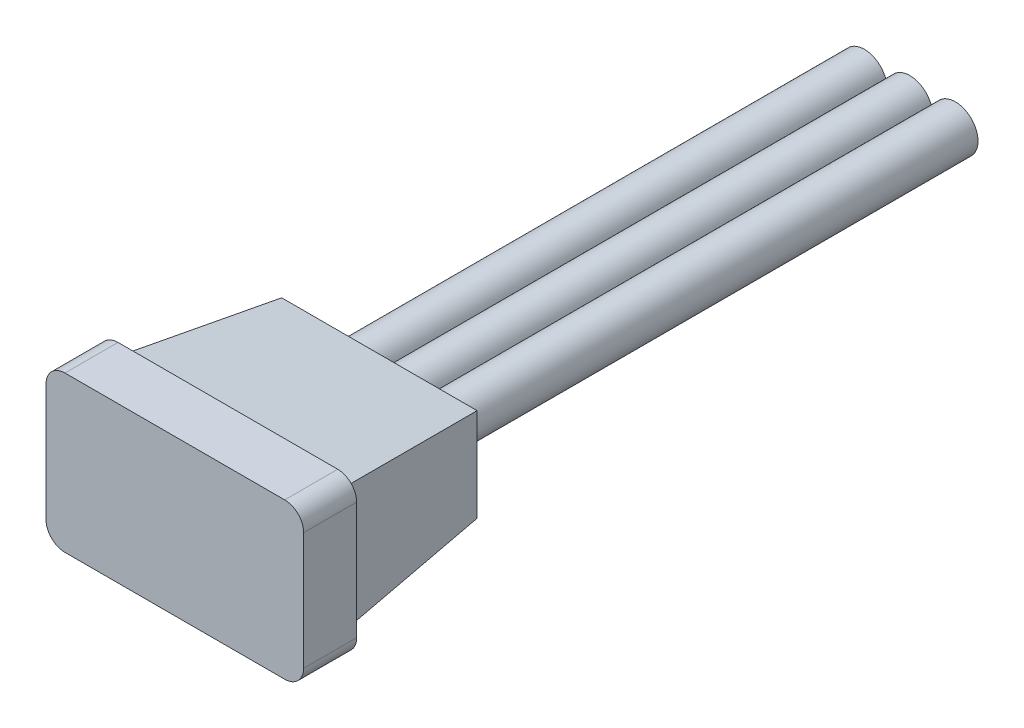
ISO-10303-21;
HEADER;
FILE_DESCRIPTION(('STEP AP214'),'2;1');
FILE_NAME('part.step','',(''),(''),'','','');
FILE_SCHEMA(('AUTOMOTIVE_DESIGN { 1 0 10303 214 1 1 1 1 }'));
ENDSEC;
DATA;
#1=APPLICATION_CONTEXT('core data for automotive mechanical design processes');
#2=APPLICATION_PROTOCOL_DEFINITION('international standard','automotive_design',2000,#1);
#3=PRODUCT_CONTEXT('',#1,'mechanical');
#4=PRODUCT('Part','Part','',(#3));
#5=PRODUCT_RELATED_PRODUCT_CATEGORY('part','',(#4));
#6=PRODUCT_DEFINITION_FORMATION('','',#4);
#7=PRODUCT_DEFINITION_CONTEXT('part definition',#1,'design');
#8=PRODUCT_DEFINITION('design','',#6,#7);
#9=PRODUCT_DEFINITION_SHAPE('','',#8);
#10=(LENGTH_UNIT() NAMED_UNIT(*) SI_UNIT(.MILLI.,.METRE.));
#11=(NAMED_UNIT(*) PLANE_ANGLE_UNIT() SI_UNIT($,.RADIAN.));
#12=(NAMED_UNIT(*) SI_UNIT($,.STERADIAN.) SOLID_ANGLE_UNIT());
#13=UNCERTAINTY_MEASURE_WITH_UNIT(LENGTH_MEASURE(1.E-05),#10,'distance_accuracy_value','');
#14=(GEOMETRIC_REPRESENTATION_CONTEXT(3) GLOBAL_UNCERTAINTY_ASSIGNED_CONTEXT((#13)) GLOBAL_UNIT_ASSIGNED_CONTEXT((#10,
#11,#12)) REPRESENTATION_CONTEXT('',''));
#15=CARTESIAN_POINT('',(0.,0.,0.));
#16=DIRECTION('',(0.,0.,1.));
#17=DIRECTION('',(1.,0.,0.));
#18=AXIS2_PLACEMENT_3D('',#15,#16,#17);
#19=CARTESIAN_POINT('',(1.2,0.,-21.0970562748477));
#20=DIRECTION('',(0.,0.,1.));
#21=DIRECTION('',(1.,0.,0.));
#22=AXIS2_PLACEMENT_3D('',#19,#20,#21);
#23=CYLINDRICAL_SURFACE('',#22,0.6);
#24=CARTESIAN_POINT('',(1.2,0.,-5.4));
#25=DIRECTION('',(0.,0.,-1.));
#26=DIRECTION('',(-1.,0.,0.));
#27=AXIS2_PLACEMENT_3D('',#24,#25,#26);
#28=CIRCLE('',#27,0.6);
#29=CARTESIAN_POINT('',(0.6,0.,-5.4));
#30=VERTEX_POINT('',#29);
#31=EDGE_CURVE('E52',#30,#30,#28,.T.);
#32=ORIENTED_EDGE('',*,*,#31,.T.);
#33=EDGE_LOOP('',(#32));
#34=FACE_BOUND('',#33,.T.);
#35=CARTESIAN_POINT('',(1.2,0.,-19.4));
#36=DIRECTION('',(0.,0.,-1.));
#37=DIRECTION('',(-1.,0.,0.));
#38=AXIS2_PLACEMENT_3D('',#35,#36,#37);
#39=CIRCLE('',#38,0.6);
#40=CARTESIAN_POINT('',(0.6,0.,-19.4));
#41=VERTEX_POINT('',#40);
#42=EDGE_CURVE('E11',#41,#41,#39,.T.);
#43=ORIENTED_EDGE('',*,*,#42,.F.);
#44=EDGE_LOOP('',(#43));
#45=FACE_BOUND('',#44,.T.);
#46=ADVANCED_FACE('F45',(#34,#45),#23,.T.);
#47=CARTESIAN_POINT('',(1.2,0.,-5.4));
#48=DIRECTION('',(0.,0.,-1.));
#49=DIRECTION('',(-1.,0.,0.));
#50=AXIS2_PLACEMENT_3D('',#47,#48,#49);
#51=PLANE('',#50);
#52=ORIENTED_EDGE('',*,*,#31,.F.);
#53=EDGE_LOOP('',(#52));
#54=FACE_BOUND('',#53,.T.);
#55=ADVANCED_FACE('F61',(#54),#51,.F.);
#56=CARTESIAN_POINT('',(0.,0.,-19.4));
#57=DIRECTION('',(0.,0.,-1.));
#58=DIRECTION('',(-1.,0.,0.));
#59=AXIS2_PLACEMENT_3D('',#56,#57,#58);
#60=PLANE('',#59);
#61=ORIENTED_EDGE('',*,*,#42,.T.);
#62=EDGE_LOOP('',(#61));
#63=FACE_BOUND('',#62,.T.);
#64=ADVANCED_FACE('F47',(#63),#60,.T.);
#65=CLOSED_SHELL('',(#46,#55,#64));
#66=MANIFOLD_SOLID_BREP('B2',#65);
#67=CARTESIAN_POINT('',(-1.2,0.,-21.0970562748477));
#68=DIRECTION('',(0.,0.,1.));
#69=DIRECTION('',(1.,0.,0.));
#70=AXIS2_PLACEMENT_3D('',#67,#68,#69);
#71=CYLINDRICAL_SURFACE('',#70,0.6);
#72=CARTESIAN_POINT('',(-1.2,0.,-5.4));
#73=DIRECTION('',(0.,0.,-1.));
#74=DIRECTION('',(-1.,0.,0.));
#75=AXIS2_PLACEMENT_3D('',#72,#73,#74);
#76=CIRCLE('',#75,0.6);
#77=CARTESIAN_POINT('',(-1.8,0.,-5.4));
#78=VERTEX_POINT('',#77);
#79=EDGE_CURVE('E103',#78,#78,#76,.T.);
#80=ORIENTED_EDGE('',*,*,#79,.T.);
#81=EDGE_LOOP('',(#80));
#82=FACE_BOUND('',#81,.T.);
#83=CARTESIAN_POINT('',(-1.2,0.,-19.4));
#84=DIRECTION('',(0.,0.,-1.));
#85=DIRECTION('',(-1.,0.,0.));
#86=AXIS2_PLACEMENT_3D('',#83,#84,#85);
#87=CIRCLE('',#86,0.6);
#88=CARTESIAN_POINT('',(-1.8,0.,-19.4));
#89=VERTEX_POINT('',#88);
#90=EDGE_CURVE('E44',#89,#89,#87,.T.);
#91=ORIENTED_EDGE('',*,*,#90,.F.);
#92=EDGE_LOOP('',(#91));
#93=FACE_BOUND('',#92,.T.);
#94=ADVANCED_FACE('F96',(#82,#93),#71,.T.);
#95=CARTESIAN_POINT('',(-1.2,0.,-5.4));
#96=DIRECTION('',(0.,0.,-1.));
#97=DIRECTION('',(-1.,0.,0.));
#98=AXIS2_PLACEMENT_3D('',#95,#96,#97);
#99=PLANE('',#98);
#100=ORIENTED_EDGE('',*,*,#79,.F.);
#101=EDGE_LOOP('',(#100));
#102=FACE_BOUND('',#101,.T.);
#103=ADVANCED_FACE('F111',(#102),#99,.F.);
#104=CARTESIAN_POINT('',(0.,0.,-19.4));
#105=DIRECTION('',(0.,0.,-1.));
#106=DIRECTION('',(-1.,0.,0.));
#107=AXIS2_PLACEMENT_3D('',#104,#105,#106);
#108=PLANE('',#107);
#109=ORIENTED_EDGE('',*,*,#90,.T.);
#110=EDGE_LOOP('',(#109));
#111=FACE_BOUND('',#110,.T.);
#112=ADVANCED_FACE('F98',(#111),#108,.T.);
#113=CLOSED_SHELL('',(#94,#103,#112));
#114=MANIFOLD_SOLID_BREP('B6',#113);
#115=CARTESIAN_POINT('',(0.,0.,-1.4));
#116=DIRECTION('',(0.,0.,1.));
#117=DIRECTION('',(1.,0.,0.));
#118=AXIS2_PLACEMENT_3D('',#115,#116,#117);
#119=PLANE('',#118);
#120=DIRECTION('',(1.,0.,0.));
#121=VECTOR('',#120,1.);
#122=CARTESIAN_POINT('',(-3.4,-2.05,-1.4));
#123=LINE('',#122,#121);
#124=CARTESIAN_POINT('',(-2.9,-2.05,-1.4));
#125=VERTEX_POINT('',#124);
#126=CARTESIAN_POINT('',(2.9,-2.05,-1.4));
#127=VERTEX_POINT('',#126);
#128=EDGE_CURVE('E291',#125,#127,#123,.T.);
#129=ORIENTED_EDGE('',*,*,#128,.F.);
#130=CARTESIAN_POINT('',(-2.9,-1.55,-1.4));
#131=DIRECTION('',(0.,0.,1.));
#132=DIRECTION('',(1.,0.,0.));
#133=AXIS2_PLACEMENT_3D('',#130,#131,#132);
#134=CIRCLE('',#133,0.5);
#135=CARTESIAN_POINT('',(-3.4,-1.55,-1.4));
#136=VERTEX_POINT('',#135);
#137=EDGE_CURVE('E333',#125,#136,#134,.F.);
#138=ORIENTED_EDGE('',*,*,#137,.T.);
#139=DIRECTION('',(0.,-1.,0.));
#140=VECTOR('',#139,1.);
#141=CARTESIAN_POINT('',(-3.4,2.05,-1.4));
#142=LINE('',#141,#140);
#143=CARTESIAN_POINT('',(-3.4,1.55,-1.4));
#144=VERTEX_POINT('',#143);
#145=EDGE_CURVE('E287',#144,#136,#142,.T.);
#146=ORIENTED_EDGE('',*,*,#145,.F.);
#147=CARTESIAN_POINT('',(-2.9,1.55,-1.4));
#148=DIRECTION('',(0.,0.,1.));
#149=DIRECTION('',(1.,0.,0.));
#150=AXIS2_PLACEMENT_3D('',#147,#148,#149);
#151=CIRCLE('',#150,0.5);
#152=CARTESIAN_POINT('',(-2.9,2.05,-1.4));
#153=VERTEX_POINT('',#152);
#154=EDGE_CURVE('E151',#144,#153,#151,.F.);
#155=ORIENTED_EDGE('',*,*,#154,.T.);
#156=DIRECTION('',(-1.,0.,0.));
#157=VECTOR('',#156,1.);
#158=CARTESIAN_POINT('',(-3.4,2.05,-1.4));
#159=LINE('',#158,#157);
#160=CARTESIAN_POINT('',(2.9,2.05,-1.4));
#161=VERTEX_POINT('',#160);
#162=EDGE_CURVE('E284',#161,#153,#159,.T.);
#163=ORIENTED_EDGE('',*,*,#162,.F.);
#164=CARTESIAN_POINT('',(2.9,1.55,-1.4));
#165=DIRECTION('',(0.,0.,1.));
#166=DIRECTION('',(1.,0.,0.));
#167=AXIS2_PLACEMENT_3D('',#164,#165,#166);
#168=CIRCLE('',#167,0.5);
#169=CARTESIAN_POINT('',(3.4,1.55,-1.4));
#170=VERTEX_POINT('',#169);
#171=EDGE_CURVE('E327',#161,#170,#168,.F.);
#172=ORIENTED_EDGE('',*,*,#171,.T.);
#173=DIRECTION('',(0.,1.,0.));
#174=VECTOR('',#173,1.);
#175=CARTESIAN_POINT('',(3.4,2.05,-1.4));
#176=LINE('',#175,#174);
#177=CARTESIAN_POINT('',(3.4,-1.55,-1.4));
#178=VERTEX_POINT('',#177);
#179=EDGE_CURVE('E281',#178,#170,#176,.T.);
#180=ORIENTED_EDGE('',*,*,#179,.F.);
#181=CARTESIAN_POINT('',(2.9,-1.55,-1.4));
#182=DIRECTION('',(0.,0.,1.));
#183=DIRECTION('',(1.,0.,0.));
#184=AXIS2_PLACEMENT_3D('',#181,#182,#183);
#185=CIRCLE('',#184,0.5);
#186=EDGE_CURVE('E329',#178,#127,#185,.F.);
#187=ORIENTED_EDGE('',*,*,#186,.T.);
#188=EDGE_LOOP('',(#129,#138,#146,#155,#163,#172,#180,#187));
#189=FACE_BOUND('',#188,.T.);
#190=DIRECTION('',(1.,0.,0.));
#191=VECTOR('',#190,1.);
#192=CARTESIAN_POINT('',(-3.,1.65,-1.4));
#193=LINE('',#192,#191);
#194=CARTESIAN_POINT('',(-3.,1.65,-1.4));
#195=VERTEX_POINT('',#194);
#196=CARTESIAN_POINT('',(3.,1.65,-1.4));
#197=VERTEX_POINT('',#196);
#198=EDGE_CURVE('E254',#195,#197,#193,.T.);
#199=ORIENTED_EDGE('',*,*,#198,.F.);
#200=DIRECTION('',(0.,1.,0.));
#201=VECTOR('',#200,1.);
#202=CARTESIAN_POINT('',(-3.,-1.65,-1.4));
#203=LINE('',#202,#201);
#204=CARTESIAN_POINT('',(-3.,-1.65,-1.4));
#205=VERTEX_POINT('',#204);
#206=EDGE_CURVE('E239',#205,#195,#203,.T.);
#207=ORIENTED_EDGE('',*,*,#206,.F.);
#208=DIRECTION('',(-1.,0.,0.));
#209=VECTOR('',#208,1.);
#210=CARTESIAN_POINT('',(3.,-1.65,-1.4));
#211=LINE('',#210,#209);
#212=CARTESIAN_POINT('',(3.,-1.65,-1.4));
#213=VERTEX_POINT('',#212);
#214=EDGE_CURVE('E234',#213,#205,#211,.T.);
#215=ORIENTED_EDGE('',*,*,#214,.F.);
#216=DIRECTION('',(0.,-1.,0.));
#217=VECTOR('',#216,1.);
#218=CARTESIAN_POINT('',(3.,1.65,-1.4));
#219=LINE('',#218,#217);
#220=EDGE_CURVE('E236',#197,#213,#219,.T.);
#221=ORIENTED_EDGE('',*,*,#220,.F.);
#222=EDGE_LOOP('',(#199,#207,#215,#221));
#223=FACE_BOUND('',#222,.T.);
#224=ADVANCED_FACE('F136',(#189,#223),#119,.F.);
#225=CARTESIAN_POINT('',(3.4,2.05,-1.4));
#226=DIRECTION('',(1.,0.,0.));
#227=DIRECTION('',(0.,1.,0.));
#228=AXIS2_PLACEMENT_3D('',#225,#226,#227);
#229=PLANE('',#228);
#230=DIRECTION('',(0.,1.,0.));
#231=VECTOR('',#230,1.);
#232=CARTESIAN_POINT('',(3.4,2.05,0.));
#233=LINE('',#232,#231);
#234=CARTESIAN_POINT('',(3.4,-1.55,0.));
#235=VERTEX_POINT('',#234);
#236=CARTESIAN_POINT('',(3.4,1.55,0.));
#237=VERTEX_POINT('',#236);
#238=EDGE_CURVE('E263',#235,#237,#233,.T.);
#239=ORIENTED_EDGE('',*,*,#238,.F.);
#240=DIRECTION('',(0.,0.,1.));
#241=VECTOR('',#240,1.);
#242=CARTESIAN_POINT('',(3.4,-1.55,-1.4));
#243=LINE('',#242,#241);
#244=EDGE_CURVE('E94',#235,#178,#243,.F.);
#245=ORIENTED_EDGE('',*,*,#244,.T.);
#246=ORIENTED_EDGE('',*,*,#179,.T.);
#247=DIRECTION('',(0.,0.,1.));
#248=VECTOR('',#247,1.);
#249=CARTESIAN_POINT('',(3.4,1.55,-1.4));
#250=LINE('',#249,#248);
#251=EDGE_CURVE('E144',#170,#237,#250,.T.);
#252=ORIENTED_EDGE('',*,*,#251,.T.);
#253=EDGE_LOOP('',(#239,#245,#246,#252));
#254=FACE_BOUND('',#253,.T.);
#255=ADVANCED_FACE('F343',(#254),#229,.T.);
#256=CARTESIAN_POINT('',(-3.4,-2.05,-1.4));
#257=DIRECTION('',(0.,-1.,0.));
#258=DIRECTION('',(0.,0.,-1.));
#259=AXIS2_PLACEMENT_3D('',#256,#257,#258);
#260=PLANE('',#259);
#261=DIRECTION('',(1.,0.,0.));
#262=VECTOR('',#261,1.);
#263=CARTESIAN_POINT('',(-3.4,-2.05,0.));
#264=LINE('',#263,#262);
#265=CARTESIAN_POINT('',(-2.9,-2.05,0.));
#266=VERTEX_POINT('',#265);
#267=CARTESIAN_POINT('',(2.9,-2.05,0.));
#268=VERTEX_POINT('',#267);
#269=EDGE_CURVE('E285',#266,#268,#264,.T.);
#270=ORIENTED_EDGE('',*,*,#269,.F.);
#271=DIRECTION('',(0.,0.,1.));
#272=VECTOR('',#271,1.);
#273=CARTESIAN_POINT('',(-2.9,-2.05,-1.4));
#274=LINE('',#273,#272);
#275=EDGE_CURVE('E324',#266,#125,#274,.F.);
#276=ORIENTED_EDGE('',*,*,#275,.T.);
#277=ORIENTED_EDGE('',*,*,#128,.T.);
#278=DIRECTION('',(0.,0.,1.));
#279=VECTOR('',#278,1.);
#280=CARTESIAN_POINT('',(2.9,-2.05,-1.4));
#281=LINE('',#280,#279);
#282=EDGE_CURVE('E321',#127,#268,#281,.T.);
#283=ORIENTED_EDGE('',*,*,#282,.T.);
#284=EDGE_LOOP('',(#270,#276,#277,#283));
#285=FACE_BOUND('',#284,.T.);
#286=ADVANCED_FACE('F356',(#285),#260,.T.);
#287=CARTESIAN_POINT('',(-3.4,2.05,-1.4));
#288=DIRECTION('',(-1.,0.,0.));
#289=DIRECTION('',(0.,-1.,0.));
#290=AXIS2_PLACEMENT_3D('',#287,#288,#289);
#291=PLANE('',#290);
#292=ORIENTED_EDGE('',*,*,#145,.T.);
#293=DIRECTION('',(0.,0.,1.));
#294=VECTOR('',#293,1.);
#295=CARTESIAN_POINT('',(-3.4,-1.55,-1.4));
#296=LINE('',#295,#294);
#297=CARTESIAN_POINT('',(-3.4,-1.55,0.));
#298=VERTEX_POINT('',#297);
#299=EDGE_CURVE('E309',#136,#298,#296,.T.);
#300=ORIENTED_EDGE('',*,*,#299,.T.);
#301=DIRECTION('',(0.,-1.,0.));
#302=VECTOR('',#301,1.);
#303=CARTESIAN_POINT('',(-3.4,2.05,0.));
#304=LINE('',#303,#302);
#305=CARTESIAN_POINT('',(-3.4,1.55,0.));
#306=VERTEX_POINT('',#305);
#307=EDGE_CURVE('E301',#306,#298,#304,.T.);
#308=ORIENTED_EDGE('',*,*,#307,.F.);
#309=DIRECTION('',(0.,0.,1.));
#310=VECTOR('',#309,1.);
#311=CARTESIAN_POINT('',(-3.4,1.55,-1.4));
#312=LINE('',#311,#310);
#313=EDGE_CURVE('E306',#306,#144,#312,.F.);
#314=ORIENTED_EDGE('',*,*,#313,.T.);
#315=EDGE_LOOP('',(#292,#300,#308,#314));
#316=FACE_BOUND('',#315,.T.);
#317=ADVANCED_FACE('F365',(#316),#291,.T.);
#318=CARTESIAN_POINT('',(-3.4,2.05,-1.4));
#319=DIRECTION('',(0.,1.,0.));
#320=DIRECTION('',(0.,0.,1.));
#321=AXIS2_PLACEMENT_3D('',#318,#319,#320);
#322=PLANE('',#321);
#323=ORIENTED_EDGE('',*,*,#162,.T.);
#324=DIRECTION('',(0.,0.,1.));
#325=VECTOR('',#324,1.);
#326=CARTESIAN_POINT('',(-2.9,2.05,-1.4));
#327=LINE('',#326,#325);
#328=CARTESIAN_POINT('',(-2.9,2.05,0.));
#329=VERTEX_POINT('',#328);
#330=EDGE_CURVE('E337',#153,#329,#327,.T.);
#331=ORIENTED_EDGE('',*,*,#330,.T.);
#332=DIRECTION('',(-1.,0.,0.));
#333=VECTOR('',#332,1.);
#334=CARTESIAN_POINT('',(-3.4,2.05,0.));
#335=LINE('',#334,#333);
#336=CARTESIAN_POINT('',(2.9,2.05,0.));
#337=VERTEX_POINT('',#336);
#338=EDGE_CURVE('E298',#337,#329,#335,.T.);
#339=ORIENTED_EDGE('',*,*,#338,.F.);
#340=DIRECTION('',(0.,0.,1.));
#341=VECTOR('',#340,1.);
#342=CARTESIAN_POINT('',(2.9,2.05,-1.4));
#343=LINE('',#342,#341);
#344=EDGE_CURVE('E158',#337,#161,#343,.F.);
#345=ORIENTED_EDGE('',*,*,#344,.T.);
#346=EDGE_LOOP('',(#323,#331,#339,#345));
#347=FACE_BOUND('',#346,.T.);
#348=ADVANCED_FACE('F370',(#347),#322,.T.);
#349=CARTESIAN_POINT('',(0.,0.,0.));
#350=DIRECTION('',(0.,0.,1.));
#351=DIRECTION('',(1.,0.,0.));
#352=AXIS2_PLACEMENT_3D('',#349,#350,#351);
#353=PLANE('',#352);
#354=ORIENTED_EDGE('',*,*,#307,.T.);
#355=CARTESIAN_POINT('',(-2.9,-1.55,0.));
#356=DIRECTION('',(0.,0.,1.));
#357=DIRECTION('',(1.,0.,0.));
#358=AXIS2_PLACEMENT_3D('',#355,#356,#357);
#359=CIRCLE('',#358,0.5);
#360=EDGE_CURVE('E319',#298,#266,#359,.T.);
#361=ORIENTED_EDGE('',*,*,#360,.T.);
#362=ORIENTED_EDGE('',*,*,#269,.T.);
#363=CARTESIAN_POINT('',(2.9,-1.55,0.));
#364=DIRECTION('',(0.,0.,1.));
#365=DIRECTION('',(1.,0.,0.));
#366=AXIS2_PLACEMENT_3D('',#363,#364,#365);
#367=CIRCLE('',#366,0.5);
#368=EDGE_CURVE('E315',#268,#235,#367,.T.);
#369=ORIENTED_EDGE('',*,*,#368,.T.);
#370=ORIENTED_EDGE('',*,*,#238,.T.);
#371=CARTESIAN_POINT('',(2.9,1.55,0.));
#372=DIRECTION('',(0.,0.,1.));
#373=DIRECTION('',(1.,0.,0.));
#374=AXIS2_PLACEMENT_3D('',#371,#372,#373);
#375=CIRCLE('',#374,0.5);
#376=EDGE_CURVE('E313',#237,#337,#375,.T.);
#377=ORIENTED_EDGE('',*,*,#376,.T.);
#378=ORIENTED_EDGE('',*,*,#338,.T.);
#379=CARTESIAN_POINT('',(-2.9,1.55,0.));
#380=DIRECTION('',(0.,0.,1.));
#381=DIRECTION('',(1.,0.,0.));
#382=AXIS2_PLACEMENT_3D('',#379,#380,#381);
#383=CIRCLE('',#382,0.5);
#384=EDGE_CURVE('E317',#329,#306,#383,.T.);
#385=ORIENTED_EDGE('',*,*,#384,.T.);
#386=EDGE_LOOP('',(#354,#361,#362,#369,#370,#377,#378,#385));
#387=FACE_BOUND('',#386,.T.);
#388=ADVANCED_FACE('F349',(#387),#353,.T.);
#389=CARTESIAN_POINT('',(-3.,1.65,-1.4));
#390=DIRECTION('',(0.,0.994521895368273,-0.104528463267654));
#391=DIRECTION('',(0.,0.104528463267654,0.994521895368273));
#392=AXIS2_PLACEMENT_3D('',#389,#390,#391);
#393=PLANE('',#392);
#394=ORIENTED_EDGE('',*,*,#198,.T.);
#395=DIRECTION('',(0.103962051184498,0.103962051184498,0.989132844377854));
#396=VECTOR('',#395,1.);
#397=CARTESIAN_POINT('',(3.,1.65,-1.4));
#398=LINE('',#397,#396);
#399=CARTESIAN_POINT('',(2.57958305893729,1.22958305893729,-5.4));
#400=VERTEX_POINT('',#399);
#401=EDGE_CURVE('E252',#400,#197,#398,.T.);
#402=ORIENTED_EDGE('',*,*,#401,.F.);
#403=DIRECTION('',(-1.,0.,0.));
#404=VECTOR('',#403,1.);
#405=CARTESIAN_POINT('',(-3.,1.22958305893729,-5.4));
#406=LINE('',#405,#404);
#407=CARTESIAN_POINT('',(-2.57958305893729,1.22958305893729,-5.4));
#408=VERTEX_POINT('',#407);
#409=EDGE_CURVE('E270',#408,#400,#406,.F.);
#410=ORIENTED_EDGE('',*,*,#409,.F.);
#411=DIRECTION('',(-0.103962051184498,0.103962051184498,0.989132844377854));
#412=VECTOR('',#411,1.);
#413=CARTESIAN_POINT('',(-3.,1.65,-1.4));
#414=LINE('',#413,#412);
#415=EDGE_CURVE('E266',#408,#195,#414,.T.);
#416=ORIENTED_EDGE('',*,*,#415,.T.);
#417=EDGE_LOOP('',(#394,#402,#410,#416));
#418=FACE_BOUND('',#417,.T.);
#419=ADVANCED_FACE('F386',(#418),#393,.T.);
#420=CARTESIAN_POINT('',(3.,1.65,-1.4));
#421=DIRECTION('',(0.994521895368273,0.,-0.104528463267654));
#422=DIRECTION('',(-0.104528463267654,0.,-0.994521895368273));
#423=AXIS2_PLACEMENT_3D('',#420,#421,#422);
#424=PLANE('',#423);
#425=ORIENTED_EDGE('',*,*,#220,.T.);
#426=DIRECTION('',(0.103962051184498,-0.103962051184498,0.989132844377854));
#427=VECTOR('',#426,1.);
#428=CARTESIAN_POINT('',(3.,-1.65,-1.4));
#429=LINE('',#428,#427);
#430=CARTESIAN_POINT('',(2.57958305893729,-1.22958305893729,-5.4));
#431=VERTEX_POINT('',#430);
#432=EDGE_CURVE('E249',#431,#213,#429,.T.);
#433=ORIENTED_EDGE('',*,*,#432,.F.);
#434=DIRECTION('',(0.,1.,0.));
#435=VECTOR('',#434,1.);
#436=CARTESIAN_POINT('',(2.57958305893729,1.65,-5.4));
#437=LINE('',#436,#435);
#438=EDGE_CURVE('E274',#400,#431,#437,.F.);
#439=ORIENTED_EDGE('',*,*,#438,.F.);
#440=ORIENTED_EDGE('',*,*,#401,.T.);
#441=EDGE_LOOP('',(#425,#433,#439,#440));
#442=FACE_BOUND('',#441,.T.);
#443=ADVANCED_FACE('F248',(#442),#424,.T.);
#444=CARTESIAN_POINT('',(3.,-1.65,-1.4));
#445=DIRECTION('',(0.,-0.994521895368273,-0.104528463267654));
#446=DIRECTION('',(0.,0.104528463267654,-0.994521895368273));
#447=AXIS2_PLACEMENT_3D('',#444,#445,#446);
#448=PLANE('',#447);
#449=ORIENTED_EDGE('',*,*,#214,.T.);
#450=DIRECTION('',(-0.103962051184498,-0.103962051184498,0.989132844377854));
#451=VECTOR('',#450,1.);
#452=CARTESIAN_POINT('',(-3.,-1.65,-1.4));
#453=LINE('',#452,#451);
#454=CARTESIAN_POINT('',(-2.57958305893729,-1.22958305893729,-5.4));
#455=VERTEX_POINT('',#454);
#456=EDGE_CURVE('E259',#455,#205,#453,.T.);
#457=ORIENTED_EDGE('',*,*,#456,.F.);
#458=DIRECTION('',(1.,0.,0.));
#459=VECTOR('',#458,1.);
#460=CARTESIAN_POINT('',(3.,-1.22958305893729,-5.4));
#461=LINE('',#460,#459);
#462=EDGE_CURVE('E257',#431,#455,#461,.F.);
#463=ORIENTED_EDGE('',*,*,#462,.F.);
#464=ORIENTED_EDGE('',*,*,#432,.T.);
#465=EDGE_LOOP('',(#449,#457,#463,#464));
#466=FACE_BOUND('',#465,.T.);
#467=ADVANCED_FACE('F256',(#466),#448,.T.);
#468=CARTESIAN_POINT('',(-3.,-1.65,-1.4));
#469=DIRECTION('',(-0.994521895368273,0.,-0.104528463267654));
#470=DIRECTION('',(-0.104528463267654,0.,0.994521895368273));
#471=AXIS2_PLACEMENT_3D('',#468,#469,#470);
#472=PLANE('',#471);
#473=ORIENTED_EDGE('',*,*,#206,.T.);
#474=ORIENTED_EDGE('',*,*,#415,.F.);
#475=DIRECTION('',(0.,-1.,0.));
#476=VECTOR('',#475,1.);
#477=CARTESIAN_POINT('',(-2.57958305893729,-1.65,-5.4));
#478=LINE('',#477,#476);
#479=EDGE_CURVE('E278',#455,#408,#478,.F.);
#480=ORIENTED_EDGE('',*,*,#479,.F.);
#481=ORIENTED_EDGE('',*,*,#456,.T.);
#482=EDGE_LOOP('',(#473,#474,#480,#481));
#483=FACE_BOUND('',#482,.T.);
#484=ADVANCED_FACE('F445',(#483),#472,.T.);
#485=CARTESIAN_POINT('',(0.,0.,-5.4));
#486=DIRECTION('',(0.,0.,-1.));
#487=DIRECTION('',(-1.,0.,0.));
#488=AXIS2_PLACEMENT_3D('',#485,#486,#487);
#489=PLANE('',#488);
#490=CARTESIAN_POINT('',(0.,0.,-5.4));
#491=DIRECTION('',(0.,0.,-1.));
#492=DIRECTION('',(-1.,0.,0.));
#493=AXIS2_PLACEMENT_3D('',#490,#491,#492);
#494=CIRCLE('',#493,0.6);
#495=CARTESIAN_POINT('',(-0.6,0.,-5.4));
#496=VERTEX_POINT('',#495);
#497=EDGE_CURVE('E295',#496,#496,#494,.T.);
#498=ORIENTED_EDGE('',*,*,#497,.F.);
#499=EDGE_LOOP('',(#498));
#500=FACE_BOUND('',#499,.T.);
#501=ORIENTED_EDGE('',*,*,#409,.T.);
#502=ORIENTED_EDGE('',*,*,#438,.T.);
#503=ORIENTED_EDGE('',*,*,#462,.T.);
#504=ORIENTED_EDGE('',*,*,#479,.T.);
#505=EDGE_LOOP('',(#501,#502,#503,#504));
#506=FACE_BOUND('',#505,.T.);
#507=ADVANCED_FACE('F435',(#500,#506),#489,.T.);
#508=CARTESIAN_POINT('',(0.,0.,-19.4));
#509=DIRECTION('',(0.,0.,1.));
#510=DIRECTION('',(1.,0.,0.));
#511=AXIS2_PLACEMENT_3D('',#508,#509,#510);
#512=CYLINDRICAL_SURFACE('',#511,0.6);
#513=CARTESIAN_POINT('',(0.,0.,-19.4));
#514=DIRECTION('',(0.,0.,-1.));
#515=DIRECTION('',(-1.,0.,0.));
#516=AXIS2_PLACEMENT_3D('',#513,#514,#515);
#517=CIRCLE('',#516,0.6);
#518=CARTESIAN_POINT('',(-0.6,0.,-19.4));
#519=VERTEX_POINT('',#518);
#520=EDGE_CURVE('E520',#519,#519,#517,.T.);
#521=ORIENTED_EDGE('',*,*,#520,.F.);
#522=EDGE_LOOP('',(#521));
#523=FACE_BOUND('',#522,.T.);
#524=ORIENTED_EDGE('',*,*,#497,.T.);
#525=EDGE_LOOP('',(#524));
#526=FACE_BOUND('',#525,.T.);
#527=ADVANCED_FACE('F426',(#523,#526),#512,.T.);
#528=CARTESIAN_POINT('',(0.,0.,-19.4));
#529=DIRECTION('',(0.,0.,-1.));
#530=DIRECTION('',(-1.,0.,0.));
#531=AXIS2_PLACEMENT_3D('',#528,#529,#530);
#532=PLANE('',#531);
#533=ORIENTED_EDGE('',*,*,#520,.T.);
#534=EDGE_LOOP('',(#533));
#535=FACE_BOUND('',#534,.T.);
#536=ADVANCED_FACE('F395',(#535),#532,.T.);
#537=CARTESIAN_POINT('',(-2.9,-1.55,-1.4));
#538=DIRECTION('',(0.,0.,1.));
#539=DIRECTION('',(1.,0.,0.));
#540=AXIS2_PLACEMENT_3D('',#537,#538,#539);
#541=CYLINDRICAL_SURFACE('',#540,0.5);
#542=ORIENTED_EDGE('',*,*,#137,.F.);
#543=ORIENTED_EDGE('',*,*,#275,.F.);
#544=ORIENTED_EDGE('',*,*,#360,.F.);
#545=ORIENTED_EDGE('',*,*,#299,.F.);
#546=EDGE_LOOP('',(#542,#543,#544,#545));
#547=FACE_BOUND('',#546,.T.);
#548=ADVANCED_FACE('F362',(#547),#541,.T.);
#549=CARTESIAN_POINT('',(-2.9,1.55,-1.4));
#550=DIRECTION('',(0.,0.,1.));
#551=DIRECTION('',(1.,0.,0.));
#552=AXIS2_PLACEMENT_3D('',#549,#550,#551);
#553=CYLINDRICAL_SURFACE('',#552,0.5);
#554=ORIENTED_EDGE('',*,*,#154,.F.);
#555=ORIENTED_EDGE('',*,*,#313,.F.);
#556=ORIENTED_EDGE('',*,*,#384,.F.);
#557=ORIENTED_EDGE('',*,*,#330,.F.);
#558=EDGE_LOOP('',(#554,#555,#556,#557));
#559=FACE_BOUND('',#558,.T.);
#560=ADVANCED_FACE('F369',(#559),#553,.T.);
#561=CARTESIAN_POINT('',(2.9,-1.55,-1.4));
#562=DIRECTION('',(0.,0.,1.));
#563=DIRECTION('',(1.,0.,0.));
#564=AXIS2_PLACEMENT_3D('',#561,#562,#563);
#565=CYLINDRICAL_SURFACE('',#564,0.5);
#566=ORIENTED_EDGE('',*,*,#186,.F.);
#567=ORIENTED_EDGE('',*,*,#244,.F.);
#568=ORIENTED_EDGE('',*,*,#368,.F.);
#569=ORIENTED_EDGE('',*,*,#282,.F.);
#570=EDGE_LOOP('',(#566,#567,#568,#569));
#571=FACE_BOUND('',#570,.T.);
#572=ADVANCED_FACE('F354',(#571),#565,.T.);
#573=CARTESIAN_POINT('',(2.9,1.55,-1.4));
#574=DIRECTION('',(0.,0.,1.));
#575=DIRECTION('',(1.,0.,0.));
#576=AXIS2_PLACEMENT_3D('',#573,#574,#575);
#577=CYLINDRICAL_SURFACE('',#576,0.5);
#578=ORIENTED_EDGE('',*,*,#171,.F.);
#579=ORIENTED_EDGE('',*,*,#344,.F.);
#580=ORIENTED_EDGE('',*,*,#376,.F.);
#581=ORIENTED_EDGE('',*,*,#251,.F.);
#582=EDGE_LOOP('',(#578,#579,#580,#581));
#583=FACE_BOUND('',#582,.T.);
#584=ADVANCED_FACE('F138',(#583),#577,.T.);
#585=CLOSED_SHELL('',(#224,#255,#286,#317,#348,#388,#419,#443,#467,#484,#507,#527,#536,#548,
#560,#572,#584));
#586=MANIFOLD_SOLID_BREP('B39',#585);
#587=ADVANCED_BREP_SHAPE_REPRESENTATION('',(#18,#66,#114,#586),#14);
#588=SHAPE_DEFINITION_REPRESENTATION(#9,#587);
ENDSEC;
END-ISO-10303-21;
